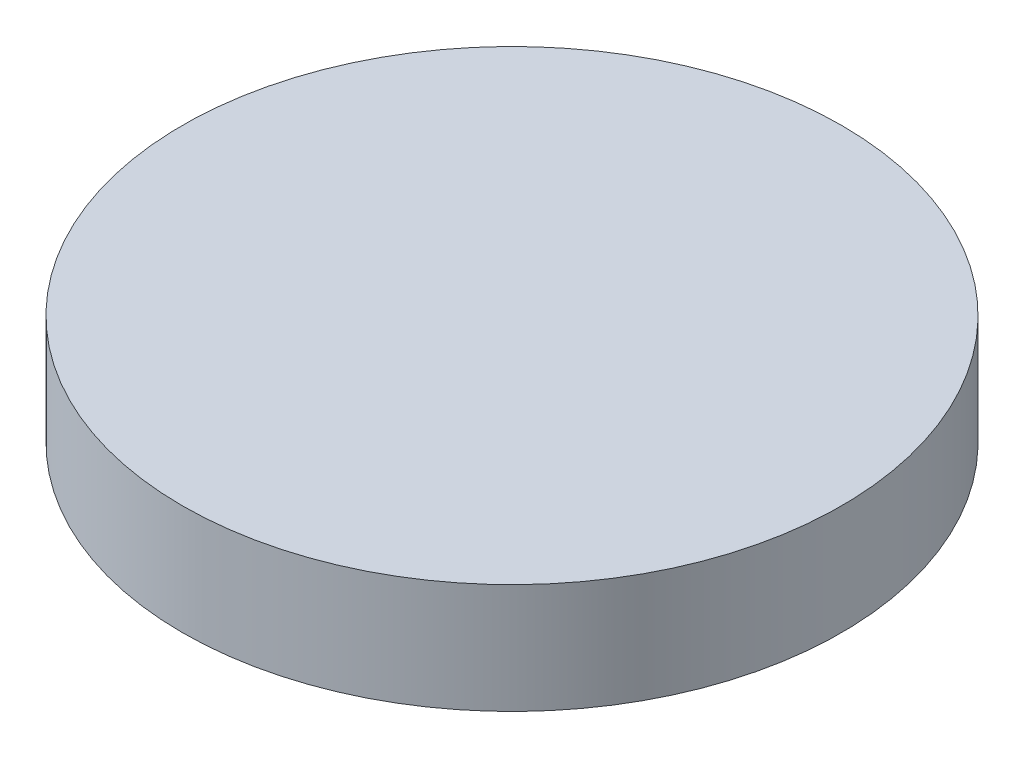
ISO-10303-21;
HEADER;
FILE_DESCRIPTION(('STEP AP214'),'2;1');
FILE_NAME('part.step','',(''),(''),'','','');
FILE_SCHEMA(('AUTOMOTIVE_DESIGN { 1 0 10303 214 1 1 1 1 }'));
ENDSEC;
DATA;
#1=APPLICATION_CONTEXT('core data for automotive mechanical design processes');
#2=APPLICATION_PROTOCOL_DEFINITION('international standard','automotive_design',2000,#1);
#3=PRODUCT_CONTEXT('',#1,'mechanical');
#4=PRODUCT('Part','Part','',(#3));
#5=PRODUCT_RELATED_PRODUCT_CATEGORY('part','',(#4));
#6=PRODUCT_DEFINITION_FORMATION('','',#4);
#7=PRODUCT_DEFINITION_CONTEXT('part definition',#1,'design');
#8=PRODUCT_DEFINITION('design','',#6,#7);
#9=PRODUCT_DEFINITION_SHAPE('','',#8);
#10=(LENGTH_UNIT() NAMED_UNIT(*) SI_UNIT(.MILLI.,.METRE.));
#11=(NAMED_UNIT(*) PLANE_ANGLE_UNIT() SI_UNIT($,.RADIAN.));
#12=(NAMED_UNIT(*) SI_UNIT($,.STERADIAN.) SOLID_ANGLE_UNIT());
#13=UNCERTAINTY_MEASURE_WITH_UNIT(LENGTH_MEASURE(1.E-05),#10,'distance_accuracy_value','');
#14=(GEOMETRIC_REPRESENTATION_CONTEXT(3) GLOBAL_UNCERTAINTY_ASSIGNED_CONTEXT((#13)) GLOBAL_UNIT_ASSIGNED_CONTEXT((#10,
#11,#12)) REPRESENTATION_CONTEXT('',''));
#15=CARTESIAN_POINT('',(0.,0.,0.));
#16=DIRECTION('',(0.,0.,1.));
#17=DIRECTION('',(1.,0.,0.));
#18=AXIS2_PLACEMENT_3D('',#15,#16,#17);
#19=CARTESIAN_POINT('',(0.,5.,0.));
#20=DIRECTION('',(0.,-1.,0.));
#21=DIRECTION('',(0.,0.,-1.));
#22=AXIS2_PLACEMENT_3D('',#19,#20,#21);
#23=CYLINDRICAL_SURFACE('',#22,30.);
#24=CARTESIAN_POINT('',(0.,5.,0.));
#25=DIRECTION('',(0.,1.,0.));
#26=DIRECTION('',(0.,0.,1.));
#27=AXIS2_PLACEMENT_3D('',#24,#25,#26);
#28=CIRCLE('',#27,30.);
#29=CARTESIAN_POINT('',(0.,5.,30.));
#30=VERTEX_POINT('',#29);
#31=EDGE_CURVE('E10',#30,#30,#28,.T.);
#32=ORIENTED_EDGE('',*,*,#31,.F.);
#33=EDGE_LOOP('',(#32));
#34=FACE_BOUND('',#33,.T.);
#35=CARTESIAN_POINT('',(0.,-5.,0.));
#36=DIRECTION('',(0.,1.,0.));
#37=DIRECTION('',(0.,0.,1.));
#38=AXIS2_PLACEMENT_3D('',#35,#36,#37);
#39=CIRCLE('',#38,30.);
#40=CARTESIAN_POINT('',(0.,-5.,30.));
#41=VERTEX_POINT('',#40);
#42=EDGE_CURVE('E41',#41,#41,#39,.T.);
#43=ORIENTED_EDGE('',*,*,#42,.T.);
#44=EDGE_LOOP('',(#43));
#45=FACE_BOUND('',#44,.T.);
#46=ADVANCED_FACE('F38',(#34,#45),#23,.T.);
#47=CARTESIAN_POINT('',(0.,5.,0.));
#48=DIRECTION('',(0.,1.,0.));
#49=DIRECTION('',(0.,0.,1.));
#50=AXIS2_PLACEMENT_3D('',#47,#48,#49);
#51=PLANE('',#50);
#52=ORIENTED_EDGE('',*,*,#31,.T.);
#53=EDGE_LOOP('',(#52));
#54=FACE_BOUND('',#53,.T.);
#55=ADVANCED_FACE('F149',(#54),#51,.T.);
#56=CARTESIAN_POINT('',(0.,-5.,0.));
#57=DIRECTION('',(0.,1.,0.));
#58=DIRECTION('',(0.,0.,1.));
#59=AXIS2_PLACEMENT_3D('',#56,#57,#58);
#60=PLANE('',#59);
#61=ORIENTED_EDGE('',*,*,#42,.F.);
#62=EDGE_LOOP('',(#61));
#63=FACE_BOUND('',#62,.T.);
#64=ADVANCED_FACE('F151',(#63),#60,.F.);
#65=CLOSED_SHELL('',(#46,#55,#64));
#66=CARTESIAN_POINT('',(-12.5,-2.6,12.5));
#67=DIRECTION('',(0.,1.,0.));
#68=DIRECTION('',(0.,0.,1.));
#69=AXIS2_PLACEMENT_3D('',#66,#67,#68);
#70=CYLINDRICAL_SURFACE('',#69,2.65);
#71=CARTESIAN_POINT('',(-12.5,-2.6,12.5));
#72=DIRECTION('',(0.,1.,0.));
#73=DIRECTION('',(0.,0.,1.));
#74=AXIS2_PLACEMENT_3D('',#71,#72,#73);
#75=CIRCLE('',#74,2.65);
#76=CARTESIAN_POINT('',(-12.5,-2.6,15.15));
#77=VERTEX_POINT('',#76);
#78=EDGE_CURVE('E56',#77,#77,#75,.T.);
#79=ORIENTED_EDGE('',*,*,#78,.F.);
#80=EDGE_LOOP('',(#79));
#81=FACE_BOUND('',#80,.T.);
#82=CARTESIAN_POINT('',(-12.5,2.6,12.5));
#83=DIRECTION('',(0.,1.,0.));
#84=DIRECTION('',(0.,0.,1.));
#85=AXIS2_PLACEMENT_3D('',#82,#83,#84);
#86=CIRCLE('',#85,2.65);
#87=CARTESIAN_POINT('',(-12.5,2.6,15.15));
#88=VERTEX_POINT('',#87);
#89=EDGE_CURVE('E59',#88,#88,#86,.T.);
#90=ORIENTED_EDGE('',*,*,#89,.T.);
#91=EDGE_LOOP('',(#90));
#92=FACE_BOUND('',#91,.T.);
#93=ADVANCED_FACE('F178',(#81,#92),#70,.F.);
#94=CARTESIAN_POINT('',(-12.5,-2.6,12.5));
#95=DIRECTION('',(0.,1.,0.));
#96=DIRECTION('',(0.,0.,1.));
#97=AXIS2_PLACEMENT_3D('',#94,#95,#96);
#98=PLANE('',#97);
#99=ORIENTED_EDGE('',*,*,#78,.T.);
#100=EDGE_LOOP('',(#99));
#101=FACE_BOUND('',#100,.T.);
#102=ADVANCED_FACE('F182',(#101),#98,.T.);
#103=CARTESIAN_POINT('',(-12.5,2.6,12.5));
#104=DIRECTION('',(0.,1.,0.));
#105=DIRECTION('',(0.,0.,1.));
#106=AXIS2_PLACEMENT_3D('',#103,#104,#105);
#107=PLANE('',#106);
#108=ORIENTED_EDGE('',*,*,#89,.F.);
#109=EDGE_LOOP('',(#108));
#110=FACE_BOUND('',#109,.T.);
#111=ADVANCED_FACE('F193',(#110),#107,.F.);
#112=CLOSED_SHELL('',(#93,#102,#111));
#113=CARTESIAN_POINT('',(12.5,-2.6,12.5));
#114=DIRECTION('',(0.,1.,0.));
#115=DIRECTION('',(0.,0.,1.));
#116=AXIS2_PLACEMENT_3D('',#113,#114,#115);
#117=CYLINDRICAL_SURFACE('',#116,2.65);
#118=CARTESIAN_POINT('',(12.5,-2.6,12.5));
#119=DIRECTION('',(0.,1.,0.));
#120=DIRECTION('',(0.,0.,1.));
#121=AXIS2_PLACEMENT_3D('',#118,#119,#120);
#122=CIRCLE('',#121,2.65);
#123=CARTESIAN_POINT('',(12.5,-2.6,15.15));
#124=VERTEX_POINT('',#123);
#125=EDGE_CURVE('E62',#124,#124,#122,.T.);
#126=ORIENTED_EDGE('',*,*,#125,.F.);
#127=EDGE_LOOP('',(#126));
#128=FACE_BOUND('',#127,.T.);
#129=CARTESIAN_POINT('',(12.5,2.6,12.5));
#130=DIRECTION('',(0.,1.,0.));
#131=DIRECTION('',(0.,0.,1.));
#132=AXIS2_PLACEMENT_3D('',#129,#130,#131);
#133=CIRCLE('',#132,2.65);
#134=CARTESIAN_POINT('',(12.5,2.6,15.15));
#135=VERTEX_POINT('',#134);
#136=EDGE_CURVE('E65',#135,#135,#133,.T.);
#137=ORIENTED_EDGE('',*,*,#136,.T.);
#138=EDGE_LOOP('',(#137));
#139=FACE_BOUND('',#138,.T.);
#140=ADVANCED_FACE('F208',(#128,#139),#117,.F.);
#141=CARTESIAN_POINT('',(12.5,-2.6,12.5));
#142=DIRECTION('',(0.,1.,0.));
#143=DIRECTION('',(0.,0.,1.));
#144=AXIS2_PLACEMENT_3D('',#141,#142,#143);
#145=PLANE('',#144);
#146=ORIENTED_EDGE('',*,*,#125,.T.);
#147=EDGE_LOOP('',(#146));
#148=FACE_BOUND('',#147,.T.);
#149=ADVANCED_FACE('F212',(#148),#145,.T.);
#150=CARTESIAN_POINT('',(12.5,2.6,12.5));
#151=DIRECTION('',(0.,1.,0.));
#152=DIRECTION('',(0.,0.,1.));
#153=AXIS2_PLACEMENT_3D('',#150,#151,#152);
#154=PLANE('',#153);
#155=ORIENTED_EDGE('',*,*,#136,.F.);
#156=EDGE_LOOP('',(#155));
#157=FACE_BOUND('',#156,.T.);
#158=ADVANCED_FACE('F104',(#157),#154,.F.);
#159=CLOSED_SHELL('',(#140,#149,#158));
#160=CARTESIAN_POINT('',(12.5,-2.6,-12.5));
#161=DIRECTION('',(0.,1.,0.));
#162=DIRECTION('',(0.,0.,1.));
#163=AXIS2_PLACEMENT_3D('',#160,#161,#162);
#164=CYLINDRICAL_SURFACE('',#163,2.65);
#165=CARTESIAN_POINT('',(12.5,-2.6,-12.5));
#166=DIRECTION('',(0.,1.,0.));
#167=DIRECTION('',(0.,0.,1.));
#168=AXIS2_PLACEMENT_3D('',#165,#166,#167);
#169=CIRCLE('',#168,2.65);
#170=CARTESIAN_POINT('',(12.5,-2.6,-9.85));
#171=VERTEX_POINT('',#170);
#172=EDGE_CURVE('E68',#171,#171,#169,.T.);
#173=ORIENTED_EDGE('',*,*,#172,.F.);
#174=EDGE_LOOP('',(#173));
#175=FACE_BOUND('',#174,.T.);
#176=CARTESIAN_POINT('',(12.5,2.6,-12.5));
#177=DIRECTION('',(0.,1.,0.));
#178=DIRECTION('',(0.,0.,1.));
#179=AXIS2_PLACEMENT_3D('',#176,#177,#178);
#180=CIRCLE('',#179,2.65);
#181=CARTESIAN_POINT('',(12.5,2.6,-9.85));
#182=VERTEX_POINT('',#181);
#183=EDGE_CURVE('E53',#182,#182,#180,.T.);
#184=ORIENTED_EDGE('',*,*,#183,.T.);
#185=EDGE_LOOP('',(#184));
#186=FACE_BOUND('',#185,.T.);
#187=ADVANCED_FACE('F74',(#175,#186),#164,.F.);
#188=CARTESIAN_POINT('',(12.5,-2.6,-12.5));
#189=DIRECTION('',(0.,1.,0.));
#190=DIRECTION('',(0.,0.,1.));
#191=AXIS2_PLACEMENT_3D('',#188,#189,#190);
#192=PLANE('',#191);
#193=ORIENTED_EDGE('',*,*,#172,.T.);
#194=EDGE_LOOP('',(#193));
#195=FACE_BOUND('',#194,.T.);
#196=ADVANCED_FACE('F78',(#195),#192,.T.);
#197=CARTESIAN_POINT('',(12.5,2.6,-12.5));
#198=DIRECTION('',(0.,1.,0.));
#199=DIRECTION('',(0.,0.,1.));
#200=AXIS2_PLACEMENT_3D('',#197,#198,#199);
#201=PLANE('',#200);
#202=ORIENTED_EDGE('',*,*,#183,.F.);
#203=EDGE_LOOP('',(#202));
#204=FACE_BOUND('',#203,.T.);
#205=ADVANCED_FACE('F76',(#204),#201,.F.);
#206=CLOSED_SHELL('',(#187,#196,#205));
#207=CARTESIAN_POINT('',(-12.5,-2.6,-12.5));
#208=DIRECTION('',(0.,1.,0.));
#209=DIRECTION('',(0.,0.,1.));
#210=AXIS2_PLACEMENT_3D('',#207,#208,#209);
#211=CYLINDRICAL_SURFACE('',#210,2.65);
#212=CARTESIAN_POINT('',(-12.5,-2.6,-12.5));
#213=DIRECTION('',(0.,1.,0.));
#214=DIRECTION('',(0.,0.,1.));
#215=AXIS2_PLACEMENT_3D('',#212,#213,#214);
#216=CIRCLE('',#215,2.65);
#217=CARTESIAN_POINT('',(-12.5,-2.6,-9.85));
#218=VERTEX_POINT('',#217);
#219=EDGE_CURVE('E48',#218,#218,#216,.T.);
#220=ORIENTED_EDGE('',*,*,#219,.F.);
#221=EDGE_LOOP('',(#220));
#222=FACE_BOUND('',#221,.T.);
#223=CARTESIAN_POINT('',(-12.5,2.6,-12.5));
#224=DIRECTION('',(0.,1.,0.));
#225=DIRECTION('',(0.,0.,1.));
#226=AXIS2_PLACEMENT_3D('',#223,#224,#225);
#227=CIRCLE('',#226,2.65);
#228=CARTESIAN_POINT('',(-12.5,2.6,-9.85));
#229=VERTEX_POINT('',#228);
#230=EDGE_CURVE('E50',#229,#229,#227,.T.);
#231=ORIENTED_EDGE('',*,*,#230,.T.);
#232=EDGE_LOOP('',(#231));
#233=FACE_BOUND('',#232,.T.);
#234=ADVANCED_FACE('F118',(#222,#233),#211,.F.);
#235=CARTESIAN_POINT('',(-12.5,-2.6,-12.5));
#236=DIRECTION('',(0.,1.,0.));
#237=DIRECTION('',(0.,0.,1.));
#238=AXIS2_PLACEMENT_3D('',#235,#236,#237);
#239=PLANE('',#238);
#240=ORIENTED_EDGE('',*,*,#219,.T.);
#241=EDGE_LOOP('',(#240));
#242=FACE_BOUND('',#241,.T.);
#243=ADVANCED_FACE('F122',(#242),#239,.T.);
#244=CARTESIAN_POINT('',(-12.5,2.6,-12.5));
#245=DIRECTION('',(0.,1.,0.));
#246=DIRECTION('',(0.,0.,1.));
#247=AXIS2_PLACEMENT_3D('',#244,#245,#246);
#248=PLANE('',#247);
#249=ORIENTED_EDGE('',*,*,#230,.F.);
#250=EDGE_LOOP('',(#249));
#251=FACE_BOUND('',#250,.T.);
#252=ADVANCED_FACE('F133',(#251),#248,.F.);
#253=CLOSED_SHELL('',(#234,#243,#252));
#254=ORIENTED_CLOSED_SHELL('',*,#112,.T.);
#255=ORIENTED_CLOSED_SHELL('',*,#159,.T.);
#256=ORIENTED_CLOSED_SHELL('',*,#206,.T.);
#257=ORIENTED_CLOSED_SHELL('',*,#253,.T.);
#258=BREP_WITH_VOIDS('B2',#65,(#254,#255,#256,#257));
#259=ADVANCED_BREP_SHAPE_REPRESENTATION('',(#18,#258),#14);
#260=SHAPE_DEFINITION_REPRESENTATION(#9,#259);
ENDSEC;
END-ISO-10303-21;
